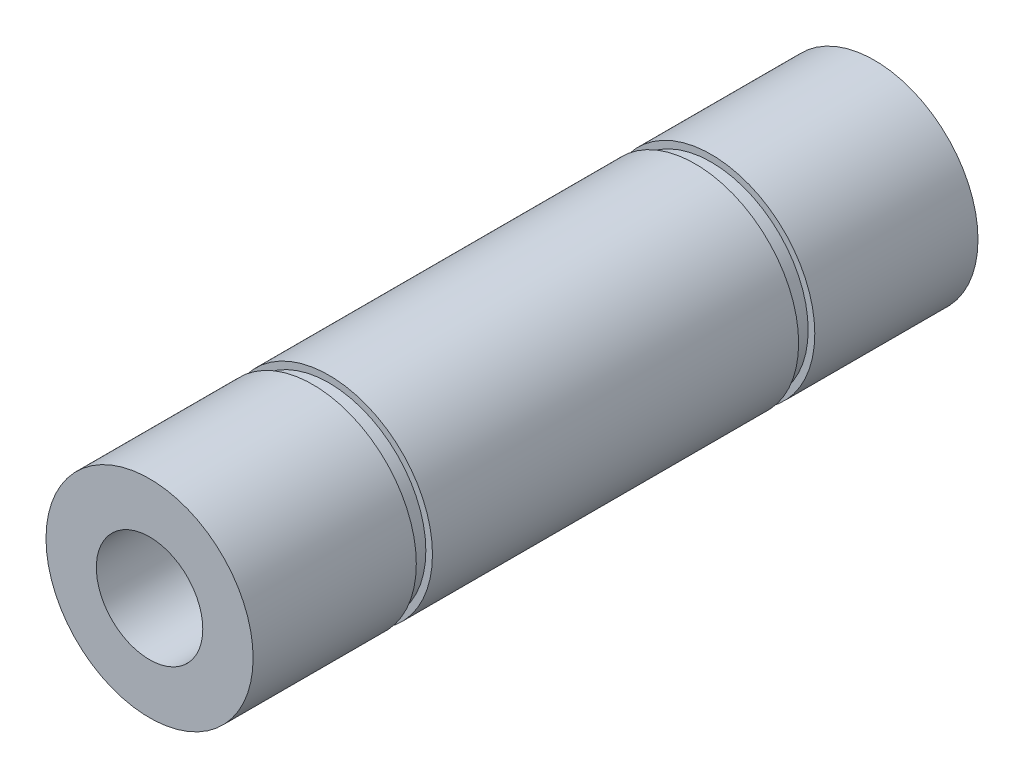
ISO-10303-21;
HEADER;
FILE_DESCRIPTION(('STEP AP214'),'2;1');
FILE_NAME('part.step','',(''),(''),'','','');
FILE_SCHEMA(('AUTOMOTIVE_DESIGN { 1 0 10303 214 1 1 1 1 }'));
ENDSEC;
DATA;
#1=APPLICATION_CONTEXT('core data for automotive mechanical design processes');
#2=APPLICATION_PROTOCOL_DEFINITION('international standard','automotive_design',2000,#1);
#3=PRODUCT_CONTEXT('',#1,'mechanical');
#4=PRODUCT('Part','Part','',(#3));
#5=PRODUCT_RELATED_PRODUCT_CATEGORY('part','',(#4));
#6=PRODUCT_DEFINITION_FORMATION('','',#4);
#7=PRODUCT_DEFINITION_CONTEXT('part definition',#1,'design');
#8=PRODUCT_DEFINITION('design','',#6,#7);
#9=PRODUCT_DEFINITION_SHAPE('','',#8);
#10=(LENGTH_UNIT() NAMED_UNIT(*) SI_UNIT(.MILLI.,.METRE.));
#11=(NAMED_UNIT(*) PLANE_ANGLE_UNIT() SI_UNIT($,.RADIAN.));
#12=(NAMED_UNIT(*) SI_UNIT($,.STERADIAN.) SOLID_ANGLE_UNIT());
#13=UNCERTAINTY_MEASURE_WITH_UNIT(LENGTH_MEASURE(1.E-05),#10,'distance_accuracy_value','');
#14=(GEOMETRIC_REPRESENTATION_CONTEXT(3) GLOBAL_UNCERTAINTY_ASSIGNED_CONTEXT((#13)) GLOBAL_UNIT_ASSIGNED_CONTEXT((#10,
#11,#12)) REPRESENTATION_CONTEXT('',''));
#15=CARTESIAN_POINT('',(0.,0.,0.));
#16=DIRECTION('',(0.,0.,1.));
#17=DIRECTION('',(1.,0.,0.));
#18=AXIS2_PLACEMENT_3D('',#15,#16,#17);
#19=CARTESIAN_POINT('',(0.,0.,22.225));
#20=DIRECTION('',(0.,0.,-1.));
#21=DIRECTION('',(-1.,0.,0.));
#22=AXIS2_PLACEMENT_3D('',#19,#20,#21);
#23=CYLINDRICAL_SURFACE('',#22,6.35);
#24=CARTESIAN_POINT('',(0.,0.,-11.2268));
#25=DIRECTION('',(0.,0.,1.));
#26=DIRECTION('',(1.,0.,0.));
#27=AXIS2_PLACEMENT_3D('',#24,#25,#26);
#28=CIRCLE('',#27,6.35);
#29=CARTESIAN_POINT('',(6.35,0.,-11.2268));
#30=VERTEX_POINT('',#29);
#31=EDGE_CURVE('E70',#30,#30,#28,.T.);
#32=ORIENTED_EDGE('',*,*,#31,.T.);
#33=EDGE_LOOP('',(#32));
#34=FACE_BOUND('',#33,.T.);
#35=CARTESIAN_POINT('',(0.,0.,11.2268));
#36=DIRECTION('',(0.,0.,1.));
#37=DIRECTION('',(1.,0.,0.));
#38=AXIS2_PLACEMENT_3D('',#35,#36,#37);
#39=CIRCLE('',#38,6.35);
#40=CARTESIAN_POINT('',(6.35,0.,11.2268));
#41=VERTEX_POINT('',#40);
#42=EDGE_CURVE('E82',#41,#41,#39,.T.);
#43=ORIENTED_EDGE('',*,*,#42,.F.);
#44=EDGE_LOOP('',(#43));
#45=FACE_BOUND('',#44,.T.);
#46=ADVANCED_FACE('F36',(#34,#45),#23,.T.);
#47=CARTESIAN_POINT('',(0.,0.,22.225));
#48=DIRECTION('',(0.,0.,1.));
#49=DIRECTION('',(1.,0.,0.));
#50=AXIS2_PLACEMENT_3D('',#47,#48,#49);
#51=CIRCLE('',#50,6.35);
#52=CARTESIAN_POINT('',(6.35,0.,22.225));
#53=VERTEX_POINT('',#52);
#54=EDGE_CURVE('E10',#53,#53,#51,.T.);
#55=ORIENTED_EDGE('',*,*,#54,.F.);
#56=EDGE_LOOP('',(#55));
#57=FACE_BOUND('',#56,.T.);
#58=CARTESIAN_POINT('',(0.,0.,12.2174));
#59=DIRECTION('',(0.,0.,1.));
#60=DIRECTION('',(1.,0.,0.));
#61=AXIS2_PLACEMENT_3D('',#58,#59,#60);
#62=CIRCLE('',#61,6.35);
#63=CARTESIAN_POINT('',(6.35,0.,12.2174));
#64=VERTEX_POINT('',#63);
#65=EDGE_CURVE('E79',#64,#64,#62,.T.);
#66=ORIENTED_EDGE('',*,*,#65,.T.);
#67=EDGE_LOOP('',(#66));
#68=FACE_BOUND('',#67,.T.);
#69=ADVANCED_FACE('F89',(#57,#68),#23,.T.);
#70=CARTESIAN_POINT('',(0.,0.,-22.225));
#71=DIRECTION('',(0.,0.,1.));
#72=DIRECTION('',(1.,0.,0.));
#73=AXIS2_PLACEMENT_3D('',#70,#71,#72);
#74=CIRCLE('',#73,6.35);
#75=CARTESIAN_POINT('',(6.35,0.,-22.225));
#76=VERTEX_POINT('',#75);
#77=EDGE_CURVE('E43',#76,#76,#74,.T.);
#78=ORIENTED_EDGE('',*,*,#77,.T.);
#79=EDGE_LOOP('',(#78));
#80=FACE_BOUND('',#79,.T.);
#81=CARTESIAN_POINT('',(0.,0.,-12.2174));
#82=DIRECTION('',(0.,0.,1.));
#83=DIRECTION('',(1.,0.,0.));
#84=AXIS2_PLACEMENT_3D('',#81,#82,#83);
#85=CIRCLE('',#84,6.35);
#86=CARTESIAN_POINT('',(6.35,0.,-12.2174));
#87=VERTEX_POINT('',#86);
#88=EDGE_CURVE('E67',#87,#87,#85,.T.);
#89=ORIENTED_EDGE('',*,*,#88,.F.);
#90=EDGE_LOOP('',(#89));
#91=FACE_BOUND('',#90,.T.);
#92=ADVANCED_FACE('F91',(#80,#91),#23,.T.);
#93=CARTESIAN_POINT('',(0.,0.,22.225));
#94=DIRECTION('',(0.,0.,1.));
#95=DIRECTION('',(1.,0.,0.));
#96=AXIS2_PLACEMENT_3D('',#93,#94,#95);
#97=PLANE('',#96);
#98=CARTESIAN_POINT('',(0.,0.,22.225));
#99=DIRECTION('',(0.,0.,1.));
#100=DIRECTION('',(1.,0.,0.));
#101=AXIS2_PLACEMENT_3D('',#98,#99,#100);
#102=CIRCLE('',#101,3.26389999999999);
#103=CARTESIAN_POINT('',(3.26389999999999,0.,22.225));
#104=VERTEX_POINT('',#103);
#105=EDGE_CURVE('E52',#104,#104,#102,.T.);
#106=ORIENTED_EDGE('',*,*,#105,.F.);
#107=EDGE_LOOP('',(#106));
#108=FACE_BOUND('',#107,.T.);
#109=ORIENTED_EDGE('',*,*,#54,.T.);
#110=EDGE_LOOP('',(#109));
#111=FACE_BOUND('',#110,.T.);
#112=ADVANCED_FACE('F97',(#108,#111),#97,.T.);
#113=CARTESIAN_POINT('',(0.,0.,-22.225));
#114=DIRECTION('',(0.,0.,1.));
#115=DIRECTION('',(1.,0.,0.));
#116=AXIS2_PLACEMENT_3D('',#113,#114,#115);
#117=PLANE('',#116);
#118=CARTESIAN_POINT('',(0.,0.,-22.225));
#119=DIRECTION('',(0.,0.,-1.));
#120=DIRECTION('',(-1.,0.,0.));
#121=AXIS2_PLACEMENT_3D('',#118,#119,#120);
#122=CIRCLE('',#121,3.26389999999999);
#123=CARTESIAN_POINT('',(-3.26389999999999,0.,-22.225));
#124=VERTEX_POINT('',#123);
#125=EDGE_CURVE('E58',#124,#124,#122,.T.);
#126=ORIENTED_EDGE('',*,*,#125,.F.);
#127=EDGE_LOOP('',(#126));
#128=FACE_BOUND('',#127,.T.);
#129=ORIENTED_EDGE('',*,*,#77,.F.);
#130=EDGE_LOOP('',(#129));
#131=FACE_BOUND('',#130,.T.);
#132=ADVANCED_FACE('F102',(#128,#131),#117,.F.);
#133=CARTESIAN_POINT('',(0.,0.,1.905));
#134=DIRECTION('',(0.,0.,1.));
#135=DIRECTION('',(1.,0.,0.));
#136=AXIS2_PLACEMENT_3D('',#133,#134,#135);
#137=CONICAL_SURFACE('',#136,3.2639,1.02974425867665);
#138=CARTESIAN_POINT('',(0.,0.,0.));
#139=DIRECTION('',(0.,0.,-1.));
#140=DIRECTION('',(-1.,0.,0.));
#141=AXIS2_PLACEMENT_3D('',#138,#139,#140);
#142=CIRCLE('',#141,0.0934475861222737);
#143=CARTESIAN_POINT('',(-0.0934475861222737,0.,0.));
#144=VERTEX_POINT('',#143);
#145=EDGE_CURVE('E39',#144,#144,#142,.T.);
#146=ORIENTED_EDGE('',*,*,#145,.T.);
#147=EDGE_LOOP('',(#146));
#148=FACE_BOUND('',#147,.T.);
#149=CARTESIAN_POINT('',(0.,0.,1.905));
#150=DIRECTION('',(0.,0.,1.));
#151=DIRECTION('',(1.,0.,0.));
#152=AXIS2_PLACEMENT_3D('',#149,#150,#151);
#153=CIRCLE('',#152,3.2639);
#154=CARTESIAN_POINT('',(3.2639,0.,1.905));
#155=VERTEX_POINT('',#154);
#156=EDGE_CURVE('E48',#155,#155,#153,.T.);
#157=ORIENTED_EDGE('',*,*,#156,.T.);
#158=EDGE_LOOP('',(#157));
#159=FACE_BOUND('',#158,.T.);
#160=ADVANCED_FACE('F140',(#148,#159),#137,.F.);
#161=CARTESIAN_POINT('',(0.,0.,22.225));
#162=DIRECTION('',(0.,0.,1.));
#163=DIRECTION('',(1.,0.,0.));
#164=AXIS2_PLACEMENT_3D('',#161,#162,#163);
#165=CYLINDRICAL_SURFACE('',#164,3.26389999999999);
#166=ORIENTED_EDGE('',*,*,#156,.F.);
#167=EDGE_LOOP('',(#166));
#168=FACE_BOUND('',#167,.T.);
#169=ORIENTED_EDGE('',*,*,#105,.T.);
#170=EDGE_LOOP('',(#169));
#171=FACE_BOUND('',#170,.T.);
#172=ADVANCED_FACE('F136',(#168,#171),#165,.F.);
#173=CARTESIAN_POINT('',(0.,0.,-1.90499999999999));
#174=DIRECTION('',(0.,0.,-1.));
#175=DIRECTION('',(-1.,0.,0.));
#176=AXIS2_PLACEMENT_3D('',#173,#174,#175);
#177=CONICAL_SURFACE('',#176,3.26389999999999,1.02974425867665);
#178=CARTESIAN_POINT('',(0.,0.,-1.90499999999999));
#179=DIRECTION('',(0.,0.,-1.));
#180=DIRECTION('',(-1.,0.,0.));
#181=AXIS2_PLACEMENT_3D('',#178,#179,#180);
#182=CIRCLE('',#181,3.26389999999999);
#183=CARTESIAN_POINT('',(-3.26389999999999,0.,-1.90499999999999));
#184=VERTEX_POINT('',#183);
#185=EDGE_CURVE('E55',#184,#184,#182,.T.);
#186=ORIENTED_EDGE('',*,*,#185,.T.);
#187=EDGE_LOOP('',(#186));
#188=FACE_BOUND('',#187,.T.);
#189=ORIENTED_EDGE('',*,*,#145,.F.);
#190=EDGE_LOOP('',(#189));
#191=FACE_BOUND('',#190,.T.);
#192=ADVANCED_FACE('F130',(#188,#191),#177,.F.);
#193=CARTESIAN_POINT('',(0.,0.,-22.225));
#194=DIRECTION('',(0.,0.,-1.));
#195=DIRECTION('',(-1.,0.,0.));
#196=AXIS2_PLACEMENT_3D('',#193,#194,#195);
#197=CYLINDRICAL_SURFACE('',#196,3.26389999999999);
#198=ORIENTED_EDGE('',*,*,#185,.F.);
#199=EDGE_LOOP('',(#198));
#200=FACE_BOUND('',#199,.T.);
#201=ORIENTED_EDGE('',*,*,#125,.T.);
#202=EDGE_LOOP('',(#201));
#203=FACE_BOUND('',#202,.T.);
#204=ADVANCED_FACE('F124',(#200,#203),#197,.F.);
#205=CARTESIAN_POINT('',(0.,6.35,-11.2268));
#206=DIRECTION('',(0.,0.,-1.));
#207=DIRECTION('',(-1.,0.,0.));
#208=AXIS2_PLACEMENT_3D('',#205,#206,#207);
#209=PLANE('',#208);
#210=CARTESIAN_POINT('',(0.,0.,-11.2268));
#211=DIRECTION('',(0.,0.,1.));
#212=DIRECTION('',(1.,0.,0.));
#213=AXIS2_PLACEMENT_3D('',#210,#211,#212);
#214=CIRCLE('',#213,5.9436);
#215=CARTESIAN_POINT('',(5.9436,0.,-11.2268));
#216=VERTEX_POINT('',#215);
#217=EDGE_CURVE('E61',#216,#216,#214,.T.);
#218=ORIENTED_EDGE('',*,*,#217,.T.);
#219=EDGE_LOOP('',(#218));
#220=FACE_BOUND('',#219,.T.);
#221=ORIENTED_EDGE('',*,*,#31,.F.);
#222=EDGE_LOOP('',(#221));
#223=FACE_BOUND('',#222,.T.);
#224=ADVANCED_FACE('F118',(#220,#223),#209,.T.);
#225=CARTESIAN_POINT('',(0.,0.,22.225));
#226=DIRECTION('',(0.,0.,1.));
#227=DIRECTION('',(1.,0.,0.));
#228=AXIS2_PLACEMENT_3D('',#225,#226,#227);
#229=CYLINDRICAL_SURFACE('',#228,5.9436);
#230=CARTESIAN_POINT('',(0.,0.,-12.2174));
#231=DIRECTION('',(0.,0.,1.));
#232=DIRECTION('',(1.,0.,0.));
#233=AXIS2_PLACEMENT_3D('',#230,#231,#232);
#234=CIRCLE('',#233,5.9436);
#235=CARTESIAN_POINT('',(5.9436,0.,-12.2174));
#236=VERTEX_POINT('',#235);
#237=EDGE_CURVE('E64',#236,#236,#234,.T.);
#238=ORIENTED_EDGE('',*,*,#237,.T.);
#239=EDGE_LOOP('',(#238));
#240=FACE_BOUND('',#239,.T.);
#241=ORIENTED_EDGE('',*,*,#217,.F.);
#242=EDGE_LOOP('',(#241));
#243=FACE_BOUND('',#242,.T.);
#244=ADVANCED_FACE('F112',(#240,#243),#229,.T.);
#245=CARTESIAN_POINT('',(0.,6.35,-12.2174));
#246=DIRECTION('',(0.,0.,1.));
#247=DIRECTION('',(1.,0.,0.));
#248=AXIS2_PLACEMENT_3D('',#245,#246,#247);
#249=PLANE('',#248);
#250=ORIENTED_EDGE('',*,*,#88,.T.);
#251=EDGE_LOOP('',(#250));
#252=FACE_BOUND('',#251,.T.);
#253=ORIENTED_EDGE('',*,*,#237,.F.);
#254=EDGE_LOOP('',(#253));
#255=FACE_BOUND('',#254,.T.);
#256=ADVANCED_FACE('F109',(#252,#255),#249,.T.);
#257=CARTESIAN_POINT('',(0.,6.35,11.2268));
#258=DIRECTION('',(0.,0.,1.));
#259=DIRECTION('',(-1.,0.,0.));
#260=AXIS2_PLACEMENT_3D('',#257,#258,#259);
#261=PLANE('',#260);
#262=CARTESIAN_POINT('',(0.,0.,11.2268));
#263=DIRECTION('',(0.,0.,1.));
#264=DIRECTION('',(1.,0.,0.));
#265=AXIS2_PLACEMENT_3D('',#262,#263,#264);
#266=CIRCLE('',#265,5.9436);
#267=CARTESIAN_POINT('',(5.9436,0.,11.2268));
#268=VERTEX_POINT('',#267);
#269=EDGE_CURVE('E73',#268,#268,#266,.T.);
#270=ORIENTED_EDGE('',*,*,#269,.F.);
#271=EDGE_LOOP('',(#270));
#272=FACE_BOUND('',#271,.T.);
#273=ORIENTED_EDGE('',*,*,#42,.T.);
#274=EDGE_LOOP('',(#273));
#275=FACE_BOUND('',#274,.T.);
#276=ADVANCED_FACE('F86',(#272,#275),#261,.T.);
#277=CARTESIAN_POINT('',(0.,0.,-22.225));
#278=DIRECTION('',(0.,0.,-1.));
#279=DIRECTION('',(1.,0.,0.));
#280=AXIS2_PLACEMENT_3D('',#277,#278,#279);
#281=CYLINDRICAL_SURFACE('',#280,5.9436);
#282=CARTESIAN_POINT('',(0.,0.,12.2174));
#283=DIRECTION('',(0.,0.,1.));
#284=DIRECTION('',(1.,0.,0.));
#285=AXIS2_PLACEMENT_3D('',#282,#283,#284);
#286=CIRCLE('',#285,5.9436);
#287=CARTESIAN_POINT('',(5.9436,0.,12.2174));
#288=VERTEX_POINT('',#287);
#289=EDGE_CURVE('E76',#288,#288,#286,.T.);
#290=ORIENTED_EDGE('',*,*,#289,.F.);
#291=EDGE_LOOP('',(#290));
#292=FACE_BOUND('',#291,.T.);
#293=ORIENTED_EDGE('',*,*,#269,.T.);
#294=EDGE_LOOP('',(#293));
#295=FACE_BOUND('',#294,.T.);
#296=ADVANCED_FACE('F226',(#292,#295),#281,.T.);
#297=CARTESIAN_POINT('',(0.,6.35,12.2174));
#298=DIRECTION('',(0.,0.,-1.));
#299=DIRECTION('',(1.,0.,0.));
#300=AXIS2_PLACEMENT_3D('',#297,#298,#299);
#301=PLANE('',#300);
#302=ORIENTED_EDGE('',*,*,#65,.F.);
#303=EDGE_LOOP('',(#302));
#304=FACE_BOUND('',#303,.T.);
#305=ORIENTED_EDGE('',*,*,#289,.T.);
#306=EDGE_LOOP('',(#305));
#307=FACE_BOUND('',#306,.T.);
#308=ADVANCED_FACE('F235',(#304,#307),#301,.T.);
#309=CLOSED_SHELL('',(#46,#69,#92,#112,#132,#160,#172,#192,#204,#224,#244,#256,#276,#296,#308));
#310=MANIFOLD_SOLID_BREP('B2',#309);
#311=ADVANCED_BREP_SHAPE_REPRESENTATION('',(#18,#310),#14);
#312=SHAPE_DEFINITION_REPRESENTATION(#9,#311);
ENDSEC;
END-ISO-10303-21;
